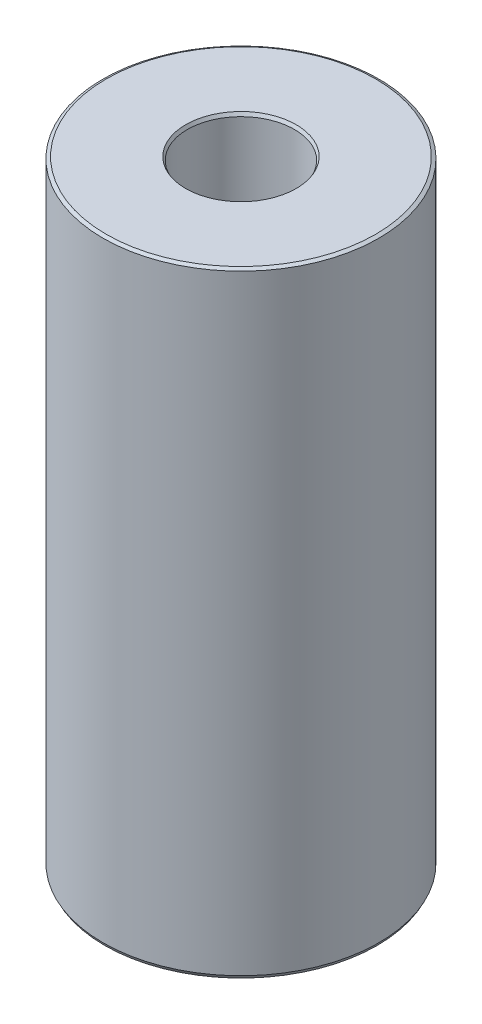
ISO-10303-21;
HEADER;
FILE_DESCRIPTION(('STEP AP214'),'2;1');
FILE_NAME('part.step','',(''),(''),'','','');
FILE_SCHEMA(('AUTOMOTIVE_DESIGN { 1 0 10303 214 1 1 1 1 }'));
ENDSEC;
DATA;
#1=APPLICATION_CONTEXT('core data for automotive mechanical design processes');
#2=APPLICATION_PROTOCOL_DEFINITION('international standard','automotive_design',2000,#1);
#3=PRODUCT_CONTEXT('',#1,'mechanical');
#4=PRODUCT('Part','Part','',(#3));
#5=PRODUCT_RELATED_PRODUCT_CATEGORY('part','',(#4));
#6=PRODUCT_DEFINITION_FORMATION('','',#4);
#7=PRODUCT_DEFINITION_CONTEXT('part definition',#1,'design');
#8=PRODUCT_DEFINITION('design','',#6,#7);
#9=PRODUCT_DEFINITION_SHAPE('','',#8);
#10=(LENGTH_UNIT() NAMED_UNIT(*) SI_UNIT(.MILLI.,.METRE.));
#11=(NAMED_UNIT(*) PLANE_ANGLE_UNIT() SI_UNIT($,.RADIAN.));
#12=(NAMED_UNIT(*) SI_UNIT($,.STERADIAN.) SOLID_ANGLE_UNIT());
#13=UNCERTAINTY_MEASURE_WITH_UNIT(LENGTH_MEASURE(1.E-05),#10,'distance_accuracy_value','');
#14=(GEOMETRIC_REPRESENTATION_CONTEXT(3) GLOBAL_UNCERTAINTY_ASSIGNED_CONTEXT((#13)) GLOBAL_UNIT_ASSIGNED_CONTEXT((#10,
#11,#12)) REPRESENTATION_CONTEXT('',''));
#15=CARTESIAN_POINT('',(0.,0.,0.));
#16=DIRECTION('',(0.,0.,1.));
#17=DIRECTION('',(1.,0.,0.));
#18=AXIS2_PLACEMENT_3D('',#15,#16,#17);
#19=CARTESIAN_POINT('',(0.,211.863747381321,0.));
#20=DIRECTION('',(0.,-1.,0.));
#21=DIRECTION('',(0.,0.,-1.));
#22=AXIS2_PLACEMENT_3D('',#19,#20,#21);
#23=CYLINDRICAL_SURFACE('',#22,47.5);
#24=CARTESIAN_POINT('',(0.,1.12478003018987,0.));
#25=DIRECTION('',(0.,1.,0.));
#26=DIRECTION('',(0.,0.,1.));
#27=AXIS2_PLACEMENT_3D('',#24,#25,#26);
#28=CIRCLE('',#27,47.5);
#29=CARTESIAN_POINT('',(0.,1.12478003018987,47.5));
#30=VERTEX_POINT('',#29);
#31=EDGE_CURVE('E10',#30,#30,#28,.T.);
#32=ORIENTED_EDGE('',*,*,#31,.T.);
#33=EDGE_LOOP('',(#32));
#34=FACE_BOUND('',#33,.T.);
#35=CARTESIAN_POINT('',(0.,211.271272973267,0.));
#36=DIRECTION('',(0.,1.,0.));
#37=DIRECTION('',(0.,0.,1.));
#38=AXIS2_PLACEMENT_3D('',#35,#36,#37);
#39=CIRCLE('',#38,47.5);
#40=CARTESIAN_POINT('',(0.,211.271272973267,47.5));
#41=VERTEX_POINT('',#40);
#42=EDGE_CURVE('E50',#41,#41,#39,.F.);
#43=ORIENTED_EDGE('',*,*,#42,.T.);
#44=EDGE_LOOP('',(#43));
#45=FACE_BOUND('',#44,.T.);
#46=ADVANCED_FACE('F39',(#34,#45),#23,.T.);
#47=CARTESIAN_POINT('',(0.,211.863747381321,0.));
#48=DIRECTION('',(0.,1.,0.));
#49=DIRECTION('',(0.,0.,1.));
#50=AXIS2_PLACEMENT_3D('',#47,#48,#49);
#51=PLANE('',#50);
#52=CARTESIAN_POINT('',(0.,211.863747381321,0.));
#53=DIRECTION('',(0.,1.,0.));
#54=DIRECTION('',(0.,0.,1.));
#55=AXIS2_PLACEMENT_3D('',#52,#53,#54);
#56=CIRCLE('',#55,19.0484692148229);
#57=CARTESIAN_POINT('',(0.,211.863747381321,19.0484692148229));
#58=VERTEX_POINT('',#57);
#59=EDGE_CURVE('E58',#58,#58,#56,.F.);
#60=ORIENTED_EDGE('',*,*,#59,.T.);
#61=EDGE_LOOP('',(#60));
#62=FACE_BOUND('',#61,.T.);
#63=CARTESIAN_POINT('',(0.,211.863747381321,0.));
#64=DIRECTION('',(0.,1.,0.));
#65=DIRECTION('',(0.,0.,1.));
#66=AXIS2_PLACEMENT_3D('',#63,#64,#65);
#67=CIRCLE('',#66,46.3752199698101);
#68=CARTESIAN_POINT('',(0.,211.863747381321,46.3752199698101));
#69=VERTEX_POINT('',#68);
#70=EDGE_CURVE('E61',#69,#69,#67,.T.);
#71=ORIENTED_EDGE('',*,*,#70,.T.);
#72=EDGE_LOOP('',(#71));
#73=FACE_BOUND('',#72,.T.);
#74=ADVANCED_FACE('F88',(#62,#73),#51,.T.);
#75=CARTESIAN_POINT('',(0.,0.,0.));
#76=DIRECTION('',(0.,1.,0.));
#77=DIRECTION('',(0.,0.,1.));
#78=AXIS2_PLACEMENT_3D('',#75,#76,#77);
#79=PLANE('',#78);
#80=CARTESIAN_POINT('',(0.,0.,0.));
#81=DIRECTION('',(0.,1.,0.));
#82=DIRECTION('',(0.,0.,1.));
#83=AXIS2_PLACEMENT_3D('',#80,#81,#82);
#84=CIRCLE('',#83,19.5807748369586);
#85=CARTESIAN_POINT('',(0.,0.,19.5807748369586));
#86=VERTEX_POINT('',#85);
#87=EDGE_CURVE('E51',#86,#86,#84,.T.);
#88=ORIENTED_EDGE('',*,*,#87,.T.);
#89=EDGE_LOOP('',(#88));
#90=FACE_BOUND('',#89,.T.);
#91=CARTESIAN_POINT('',(0.,0.,0.));
#92=DIRECTION('',(0.,1.,0.));
#93=DIRECTION('',(0.,0.,1.));
#94=AXIS2_PLACEMENT_3D('',#91,#92,#93);
#95=CIRCLE('',#94,46.9075255919458);
#96=CARTESIAN_POINT('',(0.,0.,46.9075255919458));
#97=VERTEX_POINT('',#96);
#98=EDGE_CURVE('E54',#97,#97,#95,.F.);
#99=ORIENTED_EDGE('',*,*,#98,.T.);
#100=EDGE_LOOP('',(#99));
#101=FACE_BOUND('',#100,.T.);
#102=ADVANCED_FACE('F83',(#90,#101),#79,.F.);
#103=CARTESIAN_POINT('',(0.,211.863747381321,0.));
#104=DIRECTION('',(0.,-1.,0.));
#105=DIRECTION('',(0.,0.,-1.));
#106=AXIS2_PLACEMENT_3D('',#103,#104,#105);
#107=CYLINDRICAL_SURFACE('',#106,18.4559948067688);
#108=CARTESIAN_POINT('',(0.,210.738967351132,0.));
#109=DIRECTION('',(0.,1.,0.));
#110=DIRECTION('',(0.,0.,1.));
#111=AXIS2_PLACEMENT_3D('',#108,#109,#110);
#112=CIRCLE('',#111,18.4559948067688);
#113=CARTESIAN_POINT('',(0.,210.738967351132,18.4559948067688));
#114=VERTEX_POINT('',#113);
#115=EDGE_CURVE('E67',#114,#114,#112,.T.);
#116=ORIENTED_EDGE('',*,*,#115,.T.);
#117=EDGE_LOOP('',(#116));
#118=FACE_BOUND('',#117,.T.);
#119=CARTESIAN_POINT('',(0.,0.592474408054128,0.));
#120=DIRECTION('',(0.,1.,0.));
#121=DIRECTION('',(0.,0.,1.));
#122=AXIS2_PLACEMENT_3D('',#119,#120,#121);
#123=CIRCLE('',#122,18.4559948067688);
#124=CARTESIAN_POINT('',(0.,0.592474408054128,18.4559948067688));
#125=VERTEX_POINT('',#124);
#126=EDGE_CURVE('E69',#125,#125,#123,.F.);
#127=ORIENTED_EDGE('',*,*,#126,.T.);
#128=EDGE_LOOP('',(#127));
#129=FACE_BOUND('',#128,.T.);
#130=ADVANCED_FACE('F71',(#118,#129),#107,.F.);
#131=CARTESIAN_POINT('',(0.,210.738967351132,0.));
#132=DIRECTION('',(0.,1.,0.));
#133=DIRECTION('',(0.,0.,1.));
#134=AXIS2_PLACEMENT_3D('',#131,#132,#133);
#135=CONICAL_SURFACE('',#134,18.4559948067688,0.484815472916298);
#136=CARTESIAN_POINT('',(0.,211.863747381321,19.0484692148229));
#137=CARTESIAN_POINT('',(0.,211.852030922673,19.0422976064057));
#138=CARTESIAN_POINT('',(0.,211.840314464026,19.0361259979884));
#139=CARTESIAN_POINT('',(0.,211.81688154673,19.023782781154));
#140=CARTESIAN_POINT('',(0.,211.805165088082,19.0176111727367));
#141=CARTESIAN_POINT('',(0.,211.781732170787,19.0052679559023));
#142=CARTESIAN_POINT('',(0.,211.770015712139,18.999096347485));
#143=CARTESIAN_POINT('',(0.,211.746582794843,18.9867531306506));
#144=CARTESIAN_POINT('',(0.,211.734866336195,18.9805815222334));
#145=CARTESIAN_POINT('',(0.,211.7114334189,18.9682383053989));
#146=CARTESIAN_POINT('',(0.,211.699716960252,18.9620666969817));
#147=CARTESIAN_POINT('',(0.,211.676284042956,18.9497234801472));
#148=CARTESIAN_POINT('',(0.,211.664567584308,18.94355187173));
#149=CARTESIAN_POINT('',(0.,211.641134667013,18.9312086548955));
#150=CARTESIAN_POINT('',(0.,211.629418208365,18.9250370464783));
#151=CARTESIAN_POINT('',(0.,211.605985291069,18.9126938296438));
#152=CARTESIAN_POINT('',(0.,211.594268832422,18.9065222212266));
#153=CARTESIAN_POINT('',(0.,211.570835915126,18.8941790043921));
#154=CARTESIAN_POINT('',(0.,211.559119456478,18.8880073959749));
#155=CARTESIAN_POINT('',(0.,211.535686539183,18.8756641791405));
#156=CARTESIAN_POINT('',(0.,211.523970080535,18.8694925707232));
#157=CARTESIAN_POINT('',(0.,211.500537163239,18.8571493538888));
#158=CARTESIAN_POINT('',(0.,211.488820704591,18.8509777454715));
#159=CARTESIAN_POINT('',(0.,211.465387787296,18.8386345286371));
#160=CARTESIAN_POINT('',(0.,211.453671328648,18.8324629202198));
#161=CARTESIAN_POINT('',(0.,211.430238411352,18.8201197033854));
#162=CARTESIAN_POINT('',(0.,211.418521952705,18.8139480949682));
#163=CARTESIAN_POINT('',(0.,211.395089035409,18.8016048781337));
#164=CARTESIAN_POINT('',(0.,211.383372576761,18.7954332697165));
#165=CARTESIAN_POINT('',(0.,211.359939659465,18.783090052882));
#166=CARTESIAN_POINT('',(0.,211.348223200818,18.7769184444648));
#167=CARTESIAN_POINT('',(0.,211.324790283522,18.7645752276303));
#168=CARTESIAN_POINT('',(0.,211.313073824874,18.7584036192131));
#169=CARTESIAN_POINT('',(0.,211.289640907579,18.7460604023786));
#170=CARTESIAN_POINT('',(0.,211.277924448931,18.7398887939614));
#171=CARTESIAN_POINT('',(0.,211.254491531635,18.7275455771269));
#172=CARTESIAN_POINT('',(0.,211.242775072987,18.7213739687097));
#173=CARTESIAN_POINT('',(0.,211.219342155692,18.7090307518752));
#174=CARTESIAN_POINT('',(0.,211.207625697044,18.702859143458));
#175=CARTESIAN_POINT('',(0.,211.184192779748,18.6905159266236));
#176=CARTESIAN_POINT('',(0.,211.172476321101,18.6843443182063));
#177=CARTESIAN_POINT('',(0.,211.149043403805,18.6720011013719));
#178=CARTESIAN_POINT('',(0.,211.137326945157,18.6658294929546));
#179=CARTESIAN_POINT('',(0.,211.113894027861,18.6534862761202));
#180=CARTESIAN_POINT('',(0.,211.102177569214,18.6473146677029));
#181=CARTESIAN_POINT('',(0.,211.078744651918,18.6349714508685));
#182=CARTESIAN_POINT('',(0.,211.06702819327,18.6287998424513));
#183=CARTESIAN_POINT('',(0.,211.043595275975,18.6164566256168));
#184=CARTESIAN_POINT('',(0.,211.031878817327,18.6102850171996));
#185=CARTESIAN_POINT('',(0.,211.008445900031,18.5979418003651));
#186=CARTESIAN_POINT('',(0.,210.996729441383,18.5917701919479));
#187=CARTESIAN_POINT('',(0.,210.973296524088,18.5794269751134));
#188=CARTESIAN_POINT('',(0.,210.96158006544,18.5732553666962));
#189=CARTESIAN_POINT('',(0.,210.938147148144,18.5609121498617));
#190=CARTESIAN_POINT('',(0.,210.926430689497,18.5547405414445));
#191=CARTESIAN_POINT('',(0.,210.902997772201,18.54239732461));
#192=CARTESIAN_POINT('',(0.,210.891281313553,18.5362257161928));
#193=CARTESIAN_POINT('',(0.,210.867848396257,18.5238824993583));
#194=CARTESIAN_POINT('',(0.,210.85613193761,18.5177108909411));
#195=CARTESIAN_POINT('',(0.,210.832699020314,18.5053676741067));
#196=CARTESIAN_POINT('',(0.,210.820982561666,18.4991960656894));
#197=CARTESIAN_POINT('',(0.,210.797549644371,18.486852848855));
#198=CARTESIAN_POINT('',(0.,210.785833185723,18.4806812404377));
#199=CARTESIAN_POINT('',(0.,210.762400268427,18.4683380236033));
#200=CARTESIAN_POINT('',(0.,210.750683809779,18.4621664151861));
#201=CARTESIAN_POINT('',(0.,210.738967351132,18.4559948067688));
#202=B_SPLINE_CURVE_WITH_KNOTS('',3,(#136,#137,#138,#139,#140,#141,#142,#143,#144,#145,#146,
#147,#148,#149,#150,#151,#152,#153,#154,#155,#156,#157,#158,#159,#160,#161,#162,#163,#164,#165,
#166,#167,#168,#169,#170,#171,#172,#173,#174,#175,#176,#177,#178,#179,#180,#181,#182,#183,#184,
#185,#186,#187,#188,#189,#190,#191,#192,#193,#194,#195,#196,#197,#198,#199,#200,#201),
.UNSPECIFIED.,.F.,.F.,(4,2,2,2,2,2,2,2,2,2,2,2,2,2,2,2,2,2,2,2,2,2,2,2,2,2,2,2,2,2,2,2,4),(0.,
0.0397275393564085,0.0794550787127907,0.119182618069175,0.158910157425559,0.198637696781942,
0.238365236138325,0.278092775494709,0.317820314851093,0.357547854207476,0.397275393563859,
0.437002932920243,0.476730472276627,0.516458011633009,0.556185550989393,0.595913090345777,
0.635640629702161,0.675368169058543,0.715095708414927,0.754823247771311,0.794550787127693,
0.834278326484077,0.874005865840461,0.913733405196845,0.953460944553227,0.993188483909611,
1.03291602326599,1.07264356262238,1.11237110197876,1.15209864133514,1.19182618069153,
1.23155372004791,1.27128125940429),.UNSPECIFIED.);
#203=EDGE_CURVE('BSEAM77',#58,#114,#202,.T.);
#204=ORIENTED_EDGE('',*,*,#59,.F.);
#205=ORIENTED_EDGE('',*,*,#115,.F.);
#206=ORIENTED_EDGE('',*,*,#203,.T.);
#207=ORIENTED_EDGE('',*,*,#203,.F.);
#208=EDGE_LOOP('',(#204,#206,#205,#207));
#209=FACE_BOUND('',#208,.T.);
#210=ADVANCED_FACE('F77',(#209),#135,.F.);
#211=CARTESIAN_POINT('',(0.,0.,0.));
#212=DIRECTION('',(0.,-1.,0.));
#213=DIRECTION('',(0.,0.,-1.));
#214=AXIS2_PLACEMENT_3D('',#211,#212,#213);
#215=CONICAL_SURFACE('',#214,19.5807748369586,1.0859808538786);
#216=ORIENTED_EDGE('',*,*,#126,.F.);
#217=EDGE_LOOP('',(#216));
#218=FACE_BOUND('',#217,.T.);
#219=ORIENTED_EDGE('',*,*,#87,.F.);
#220=EDGE_LOOP('',(#219));
#221=FACE_BOUND('',#220,.T.);
#222=ADVANCED_FACE('F73',(#218,#221),#215,.F.);
#223=CARTESIAN_POINT('',(0.,1.12478003018987,0.));
#224=DIRECTION('',(0.,1.,0.));
#225=DIRECTION('',(0.,0.,1.));
#226=AXIS2_PLACEMENT_3D('',#223,#224,#225);
#227=CONICAL_SURFACE('',#226,47.5,0.484815472916302);
#228=ORIENTED_EDGE('',*,*,#98,.F.);
#229=EDGE_LOOP('',(#228));
#230=FACE_BOUND('',#229,.T.);
#231=ORIENTED_EDGE('',*,*,#31,.F.);
#232=EDGE_LOOP('',(#231));
#233=FACE_BOUND('',#232,.T.);
#234=ADVANCED_FACE('F76',(#230,#233),#227,.T.);
#235=CARTESIAN_POINT('',(0.,211.863747381321,0.));
#236=DIRECTION('',(0.,-1.,0.));
#237=DIRECTION('',(0.,0.,-1.));
#238=AXIS2_PLACEMENT_3D('',#235,#236,#237);
#239=CONICAL_SURFACE('',#238,46.3752199698101,1.0859808538786);
#240=ORIENTED_EDGE('',*,*,#42,.F.);
#241=EDGE_LOOP('',(#240));
#242=FACE_BOUND('',#241,.T.);
#243=ORIENTED_EDGE('',*,*,#70,.F.);
#244=EDGE_LOOP('',(#243));
#245=FACE_BOUND('',#244,.T.);
#246=ADVANCED_FACE('F45',(#242,#245),#239,.T.);
#247=CLOSED_SHELL('',(#46,#74,#102,#130,#210,#222,#234,#246));
#248=MANIFOLD_SOLID_BREP('B2',#247);
#249=ADVANCED_BREP_SHAPE_REPRESENTATION('',(#18,#248),#14);
#250=SHAPE_DEFINITION_REPRESENTATION(#9,#249);
ENDSEC;
END-ISO-10303-21;
